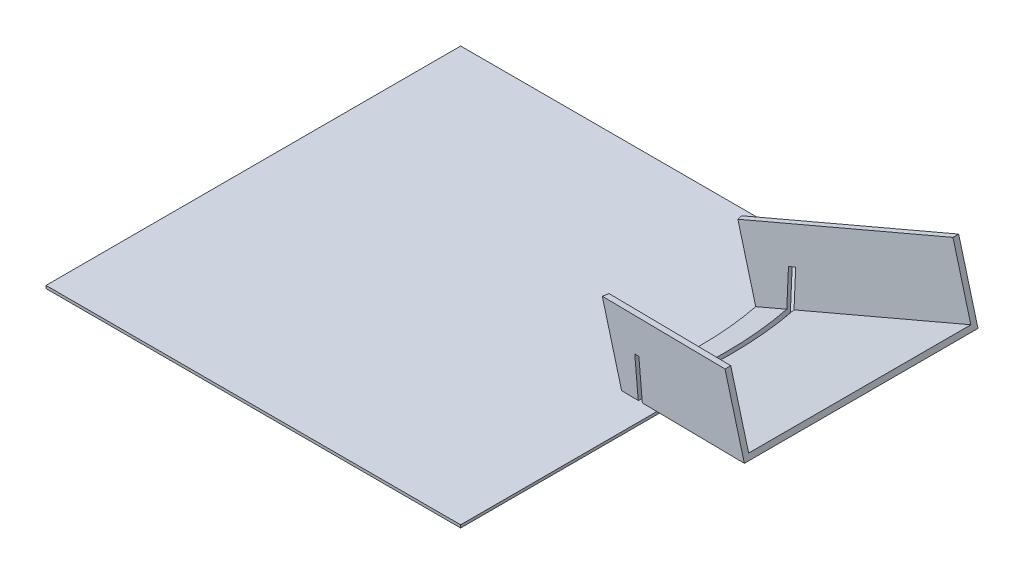
ISO-10303-21;
HEADER;
FILE_DESCRIPTION(('STEP AP214'),'2;1');
FILE_NAME('part.step','',(''),(''),'','','');
FILE_SCHEMA(('AUTOMOTIVE_DESIGN { 1 0 10303 214 1 1 1 1 }'));
ENDSEC;
DATA;
#1=APPLICATION_CONTEXT('core data for automotive mechanical design processes');
#2=APPLICATION_PROTOCOL_DEFINITION('international standard','automotive_design',2000,#1);
#3=PRODUCT_CONTEXT('',#1,'mechanical');
#4=PRODUCT('Part','Part','',(#3));
#5=PRODUCT_RELATED_PRODUCT_CATEGORY('part','',(#4));
#6=PRODUCT_DEFINITION_FORMATION('','',#4);
#7=PRODUCT_DEFINITION_CONTEXT('part definition',#1,'design');
#8=PRODUCT_DEFINITION('design','',#6,#7);
#9=PRODUCT_DEFINITION_SHAPE('','',#8);
#10=(LENGTH_UNIT() NAMED_UNIT(*) SI_UNIT(.MILLI.,.METRE.));
#11=(NAMED_UNIT(*) PLANE_ANGLE_UNIT() SI_UNIT($,.RADIAN.));
#12=(NAMED_UNIT(*) SI_UNIT($,.STERADIAN.) SOLID_ANGLE_UNIT());
#13=UNCERTAINTY_MEASURE_WITH_UNIT(LENGTH_MEASURE(1.E-05),#10,'distance_accuracy_value','');
#14=(GEOMETRIC_REPRESENTATION_CONTEXT(3) GLOBAL_UNCERTAINTY_ASSIGNED_CONTEXT((#13)) GLOBAL_UNIT_ASSIGNED_CONTEXT((#10,
#11,#12)) REPRESENTATION_CONTEXT('',''));
#15=CARTESIAN_POINT('',(0.,0.,0.));
#16=DIRECTION('',(0.,0.,1.));
#17=DIRECTION('',(1.,0.,0.));
#18=AXIS2_PLACEMENT_3D('',#15,#16,#17);
#19=CARTESIAN_POINT('',(-0.51763809020504,1.93185165257812,0.));
#20=DIRECTION('',(0.258819045102521,-0.965925826289068,0.));
#21=DIRECTION('',(0.965925826289068,0.258819045102521,0.));
#22=AXIS2_PLACEMENT_3D('',#19,#20,#21);
#23=PLANE('',#22);
#24=CARTESIAN_POINT('',(87.0769130288738,25.402740886302,-40.6746874108865));
#25=CARTESIAN_POINT('',(87.6211851797941,25.5485781696039,-39.4258886918014));
#26=CARTESIAN_POINT('',(88.1403614387907,25.6876910289315,-38.1653688409543));
#27=CARTESIAN_POINT('',(89.1276975815809,25.9522469510501,-35.6230861519321));
#28=CARTESIAN_POINT('',(89.5958572152935,26.0776899468323,-34.3413232096598));
#29=CARTESIAN_POINT('',(90.4805150127521,26.3147332892392,-31.7582261636563));
#30=CARTESIAN_POINT('',(90.8969915009452,26.4263278279171,-30.4568841033974));
#31=CARTESIAN_POINT('',(91.6773367046445,26.6354206950658,-27.8374148489102));
#32=CARTESIAN_POINT('',(92.0412058564802,26.7329191404508,-26.5192877939967));
#33=CARTESIAN_POINT('',(92.7157250357641,26.9136560098192,-23.8684575904087));
#34=CARTESIAN_POINT('',(93.0263727396073,26.9968938111946,-22.5357538080271));
#35=CARTESIAN_POINT('',(93.5938930621964,27.1489604233206,-19.8581303997071));
#36=CARTESIAN_POINT('',(93.850765684609,27.2177892350537,-18.5132107746015));
#37=CARTESIAN_POINT('',(94.3101880028607,27.3408910742141,-15.8140900174759));
#38=CARTESIAN_POINT('',(94.5127621792461,27.3951706611839,-14.4598933514064));
#39=CARTESIAN_POINT('',(94.8633753764952,27.4891171842425,-11.7440737327836));
#40=CARTESIAN_POINT('',(95.0114191296456,27.5287853883437,-10.3824514350575));
#41=CARTESIAN_POINT('',(95.2523608878193,27.5933455378693,-7.65830794900354));
#42=CARTESIAN_POINT('',(95.3454309143116,27.6182835763074,-6.29580306467403));
#43=CARTESIAN_POINT('',(95.4769860741183,27.6535336751378,-3.56804055193424));
#44=CARTESIAN_POINT('',(95.515473951899,27.6638464709075,-2.20278306538561));
#45=CARTESIAN_POINT('',(95.5378419857132,27.6698399675043,0.532434532122113));
#46=CARTESIAN_POINT('',(95.5215529076747,27.6654753221984,1.90239612980265));
#47=CARTESIAN_POINT('',(95.4340193736763,27.6420207824529,4.6405242847275));
#48=CARTESIAN_POINT('',(95.3627713629109,27.622929935506,6.00869072012445));
#49=CARTESIAN_POINT('',(95.1653714661569,27.5700367925848,8.74170509227862));
#50=CARTESIAN_POINT('',(95.0391824453295,27.5362245463604,10.1065501555711));
#51=CARTESIAN_POINT('',(94.7321018581203,27.4539425510064,12.8297204511058));
#52=CARTESIAN_POINT('',(94.5512064196421,27.4054717643517,14.1880452149284));
#53=CARTESIAN_POINT('',(94.1214035544283,27.2903064337131,16.9843668998202));
#54=CARTESIAN_POINT('',(93.8688196409005,27.2226267780622,18.4217596946485));
#55=CARTESIAN_POINT('',(93.3023485176144,27.0708412980421,21.283835128287));
#56=CARTESIAN_POINT('',(92.9884489365707,26.986732158797,22.7085151413578));
#57=CARTESIAN_POINT('',(92.2999580761813,26.8022515887595,25.5422292562194));
#58=CARTESIAN_POINT('',(91.9253604748592,26.7018784639986,26.9512617118934));
#59=CARTESIAN_POINT('',(91.1157394191213,26.4849411559384,29.7524736431197));
#60=CARTESIAN_POINT('',(90.6806426160459,26.3683573189249,31.1446303971707));
#61=CARTESIAN_POINT('',(89.7512633834368,26.1193309040851,33.9074653509221));
#62=CARTESIAN_POINT('',(89.2569862949214,25.9868897573802,35.2781454762798));
#63=CARTESIAN_POINT('',(88.2103041317324,25.7064321170216,37.9952294433844));
#64=CARTESIAN_POINT('',(87.6579092615974,25.5584183576658,39.3416374984442));
#65=CARTESIAN_POINT('',(87.0769130288235,25.4027408862886,40.6746874110017));
#66=B_SPLINE_CURVE_WITH_KNOTS('',3,(#24,#25,#26,#27,#28,#29,#30,#31,#32,#33,#34,#35,#36,#37,#38,
#39,#40,#41,#42,#43,#44,#45,#46,#47,#48,#49,#50,#51,#52,#53,#54,#55,#56,#57,#58,#59,#60,#61,#62,
#63,#64,#65),.UNSPECIFIED.,.F.,.F.,(4,2,2,2,2,2,2,2,2,2,2,2,2,2,2,2,2,2,2,2,4),(0.,
4.10981028734232,8.21964071985754,12.3311890030434,16.4427031827737,20.5543968221553,
24.666090181192,28.7759266463208,32.8854063654794,36.9819577993165,41.078303245562,
45.1873160135834,49.2965945794492,53.4086549447303,57.5210064279926,61.9025117242511,
66.2849019647372,70.6677489449489,75.0559567463639,79.4437688103067,83.8308117274082),.UNSPECIFIED.);
#67=CARTESIAN_POINT('',(92.2401902959019,26.7862368603002,-25.7311529842322));
#68=VERTEX_POINT('',#67);
#69=CARTESIAN_POINT('',(92.2401902958948,26.7862368602983,25.7311529842891));
#70=VERTEX_POINT('',#69);
#71=EDGE_CURVE('E67',#68,#70,#66,.T.);
#72=ORIENTED_EDGE('',*,*,#71,.F.);
#73=DIRECTION('',(0.93301270189222,0.250000000000001,-0.258819045102518));
#74=VECTOR('',#73,1.);
#75=CARTESIAN_POINT('',(-0.517638090190828,1.93185165258193,5.49080897015602E-11));
#76=LINE('',#75,#74);
#77=CARTESIAN_POINT('',(83.4535050798215,24.4318516524532,-23.2937140590884));
#78=VERTEX_POINT('',#77);
#79=EDGE_CURVE('E302',#78,#68,#76,.T.);
#80=ORIENTED_EDGE('',*,*,#79,.F.);
#81=CARTESIAN_POINT('',(-0.517638090205043,1.93185165257814,0.));
#82=DIRECTION('',(0.258819045102521,-0.965925826289068,0.));
#83=DIRECTION('',(0.965925826289068,0.258819045102521,0.));
#84=AXIS2_PLACEMENT_3D('',#81,#82,#83);
#85=CIRCLE('',#84,90.);
#86=CARTESIAN_POINT('',(83.4535050797943,24.4318516524977,23.2937140591433));
#87=VERTEX_POINT('',#86);
#88=EDGE_CURVE('E319',#87,#78,#85,.F.);
#89=ORIENTED_EDGE('',*,*,#88,.F.);
#90=DIRECTION('',(-0.93301270189222,-0.250000000000001,-0.258819045102518));
#91=VECTOR('',#90,1.);
#92=CARTESIAN_POINT('',(-0.517638090205041,1.93185165257812,0.));
#93=LINE('',#92,#91);
#94=EDGE_CURVE('E393',#70,#87,#93,.T.);
#95=ORIENTED_EDGE('',*,*,#94,.F.);
#96=EDGE_LOOP('',(#72,#80,#89,#95));
#97=FACE_BOUND('',#96,.T.);
#98=ADVANCED_FACE('F45',(#97),#23,.F.);
#99=CARTESIAN_POINT('',(0.,0.,0.));
#100=DIRECTION('',(0.258819045102521,-0.965925826289068,0.));
#101=DIRECTION('',(0.965925826289068,0.258819045102521,0.));
#102=AXIS2_PLACEMENT_3D('',#99,#100,#101);
#103=PLANE('',#102);
#104=CARTESIAN_POINT('',(0.,0.,0.));
#105=DIRECTION('',(0.258819045102521,-0.965925826289068,0.));
#106=DIRECTION('',(0.965925826289068,0.258819045102521,0.));
#107=AXIS2_PLACEMENT_3D('',#104,#105,#106);
#108=CIRCLE('',#107,98.9);
#109=CARTESIAN_POINT('',(91.7560864879257,24.58596927508,-27.5238207236043));
#110=VERTEX_POINT('',#109);
#111=CARTESIAN_POINT('',(91.7560864879257,24.58596927508,27.5238207236043));
#112=VERTEX_POINT('',#111);
#113=EDGE_CURVE('E205',#110,#112,#108,.T.);
#114=ORIENTED_EDGE('',*,*,#113,.T.);
#115=DIRECTION('',(-0.93301270189222,-0.250000000000001,-0.258819045102518));
#116=VECTOR('',#115,1.);
#117=CARTESIAN_POINT('',(-0.499999999999989,-0.133974596215571,1.93185165257813));
#118=LINE('',#117,#116);
#119=CARTESIAN_POINT('',(83.4504069943643,22.3604691621885,25.2198134672278));
#120=VERTEX_POINT('',#119);
#121=EDGE_CURVE('E328',#112,#120,#118,.T.);
#122=ORIENTED_EDGE('',*,*,#121,.T.);
#123=CARTESIAN_POINT('',(0.,0.,0.));
#124=DIRECTION('',(0.258819045102521,-0.965925826289068,0.));
#125=DIRECTION('',(0.965925826289068,0.258819045102521,0.));
#126=AXIS2_PLACEMENT_3D('',#123,#124,#125);
#127=CIRCLE('',#126,90.);
#128=CARTESIAN_POINT('',(83.4504069943643,22.3604691621885,-25.2198134672278));
#129=VERTEX_POINT('',#128);
#130=EDGE_CURVE('E320',#120,#129,#127,.F.);
#131=ORIENTED_EDGE('',*,*,#130,.T.);
#132=DIRECTION('',(-0.93301270189222,-0.250000000000001,0.258819045102518));
#133=VECTOR('',#132,1.);
#134=CARTESIAN_POINT('',(-0.499999999999987,-0.133974596215571,-1.93185165257812));
#135=LINE('',#134,#133);
#136=EDGE_CURVE('E75',#110,#129,#135,.T.);
#137=ORIENTED_EDGE('',*,*,#136,.F.);
#138=EDGE_LOOP('',(#114,#122,#131,#137));
#139=FACE_BOUND('',#138,.T.);
#140=ADVANCED_FACE('F356',(#139),#103,.T.);
#141=CARTESIAN_POINT('',(94.2928202147177,27.3362373894069,-26.3005554312293));
#142=VERTEX_POINT('',#141);
#143=CARTESIAN_POINT('',(144.371235853023,40.754708417921,-40.1923788645118));
#144=VERTEX_POINT('',#143);
#145=EDGE_CURVE('E295',#142,#144,#76,.T.);
#146=ORIENTED_EDGE('',*,*,#145,.F.);
#147=CARTESIAN_POINT('',(89.4031004578175,26.026040929331,-40.6746874108866));
#148=CARTESIAN_POINT('',(89.947503475897,26.1719132783824,-39.3922206143324));
#149=CARTESIAN_POINT('',(90.4661278526691,26.3108782613136,-38.0980270206445));
#150=CARTESIAN_POINT('',(91.4509933415093,26.5747721737016,-35.4884546157586));
#151=CARTESIAN_POINT('',(91.9172345964103,26.6997011414304,-34.1730758623373));
#152=CARTESIAN_POINT('',(92.7964872588461,26.935296182273,-31.5234655493608));
#153=CARTESIAN_POINT('',(93.2095015198405,27.045963019969,-30.1892350046948));
#154=CARTESIAN_POINT('',(93.9816208533382,27.2528517718402,-27.5041599828305));
#155=CARTESIAN_POINT('',(94.3407259663566,27.3490736968713,-26.1533155181191));
#156=CARTESIAN_POINT('',(95.0044000237904,27.5269046245982,-23.4373677256581));
#157=CARTESIAN_POINT('',(95.3089698935274,27.6085138752331,-22.0722646402563));
#158=CARTESIAN_POINT('',(95.8630804324265,27.7569873466487,-19.3300103862722));
#159=CARTESIAN_POINT('',(96.1126160886829,27.8238502242253,-17.9528581320348));
#160=CARTESIAN_POINT('',(96.5561711841199,27.9427004538464,-15.1891354809612));
#161=CARTESIAN_POINT('',(96.7501957585116,27.9946891818664,-13.802565967452));
#162=CARTESIAN_POINT('',(97.0824396598235,28.0837136669131,-11.0221497419354));
#163=CARTESIAN_POINT('',(97.2206538469003,28.1207480467229,-9.62830237164381));
#164=CARTESIAN_POINT('',(97.4410023519082,28.1797902506931,-6.83599521458522));
#165=CARTESIAN_POINT('',(97.5231418808168,28.2017994711309,-5.43753586854547));
#166=CARTESIAN_POINT('',(97.6312259248108,28.2307605034338,-2.63813338804213));
#167=CARTESIAN_POINT('',(97.6571640996855,28.2377106164446,-1.23718999118677));
#168=CARTESIAN_POINT('',(97.6527819654069,28.2365364271035,1.56457778274479));
#169=CARTESIAN_POINT('',(97.6224626252384,28.2284123843903,2.96540216145538));
#170=CARTESIAN_POINT('',(97.5056260883888,28.197106128695,5.76437844746752));
#171=CARTESIAN_POINT('',(97.4191153173751,28.1739256374653,7.1625306420092));
#172=CARTESIAN_POINT('',(97.1927021192202,28.1132584038639,9.92161330637928));
#173=CARTESIAN_POINT('',(97.0540810293122,28.0761149947692,11.2826566572632));
#174=CARTESIAN_POINT('',(96.7236039931063,27.9875639398007,13.9976731363261));
#175=CARTESIAN_POINT('',(96.5317529504767,27.9361576078611,15.3516469040716));
#176=CARTESIAN_POINT('',(96.0951082947631,27.8191590249833,18.0505305040782));
#177=CARTESIAN_POINT('',(95.8503102434607,27.7535655848281,19.3954395667504));
#178=CARTESIAN_POINT('',(95.3082080684862,27.6083097448285,22.0737482130029));
#179=CARTESIAN_POINT('',(95.0109083277485,27.5286485193878,23.407148747597));
#180=CARTESIAN_POINT('',(94.3553376614264,27.3529888887653,26.0970394666428));
#181=CARTESIAN_POINT('',(93.9956084567449,27.256599738877,27.4531489856711));
#182=CARTESIAN_POINT('',(93.2218272012264,27.0492656763425,30.148661491175));
#183=CARTESIAN_POINT('',(92.807774791785,26.9383206676085,31.488064367301));
#184=CARTESIAN_POINT('',(91.9260116866401,26.7020529556694,34.147981457511));
#185=CARTESIAN_POINT('',(91.4582946576809,26.5767285554735,35.4684934214502));
#186=CARTESIAN_POINT('',(90.4700769691938,26.3119364238972,38.088171579805));
#187=CARTESIAN_POINT('',(89.9495764659026,26.1724687343803,39.3873378373897));
#188=CARTESIAN_POINT('',(89.4031004577687,26.0260409293179,40.6746874110017));
#189=B_SPLINE_CURVE_WITH_KNOTS('',3,(#147,#148,#149,#150,#151,#152,#153,#154,#155,#156,#157,
#158,#159,#160,#161,#162,#163,#164,#165,#166,#167,#168,#169,#170,#171,#172,#173,#174,#175,#176,
#177,#178,#179,#180,#181,#182,#183,#184,#185,#186,#187,#188),.UNSPECIFIED.,.F.,.F.,(4,2,2,2,2,2,
2,2,2,2,2,2,2,2,2,2,2,2,2,2,4),(0.,4.202238580539,8.4044657025521,12.6064674524869,
16.8084660444253,21.0103933325895,25.2127032041067,29.4146242031589,33.6169320888454,
37.8188494039254,42.0212407228,46.2235596599582,50.4253981332611,54.5300403785164,
58.6343046199552,62.7389130297611,66.8431789414018,71.0609018316735,75.2786525658494,
79.4969015728675,83.7151380944184),.UNSPECIFIED.);
#190=CARTESIAN_POINT('',(94.2928202147035,27.3362373894029,26.3005554312842));
#191=VERTEX_POINT('',#190);
#192=EDGE_CURVE('E223',#142,#191,#189,.T.);
#193=ORIENTED_EDGE('',*,*,#192,.T.);
#194=CARTESIAN_POINT('',(144.371235853007,40.7547084179166,40.1923788646268));
#195=VERTEX_POINT('',#194);
#196=EDGE_CURVE('E389',#195,#191,#93,.T.);
#197=ORIENTED_EDGE('',*,*,#196,.F.);
#198=DIRECTION('',(0.,0.,1.));
#199=VECTOR('',#198,1.);
#200=CARTESIAN_POINT('',(144.371235853155,40.7547084179563,0.));
#201=LINE('',#200,#199);
#202=EDGE_CURVE('E301',#144,#195,#201,.T.);
#203=ORIENTED_EDGE('',*,*,#202,.F.);
#204=EDGE_LOOP('',(#146,#193,#197,#203));
#205=FACE_BOUND('',#204,.T.);
#206=ADVANCED_FACE('F299',(#205),#23,.F.);
#207=CARTESIAN_POINT('',(-1.01763809020503,1.79787705636257,-1.93185165257812));
#208=DIRECTION('',(0.249999999999998,0.0669872981077802,0.965925826289069));
#209=DIRECTION('',(0.968100345886376,0.,-0.250562807085729));
#210=AXIS2_PLACEMENT_3D('',#207,#208,#209);
#211=PLANE('',#210);
#212=CARTESIAN_POINT('',(144.88887394336,38.8228567653782,-42.2629312254881));
#213=VERTEX_POINT('',#212);
#214=CARTESIAN_POINT('',(93.8091251306055,25.136079321416,-28.0933365511802));
#215=VERTEX_POINT('',#214);
#216=EDGE_CURVE('E322',#213,#215,#135,.T.);
#217=ORIENTED_EDGE('',*,*,#216,.T.);
#218=CARTESIAN_POINT('',(93.8091251306056,25.136079321416,-28.0933365511802));
#219=CARTESIAN_POINT('',(93.7641703607774,27.623825757459,-28.2542274968833));
#220=CARTESIAN_POINT('',(93.7188250960268,30.1115715455457,-28.4150173301275));
#221=CARTESIAN_POINT('',(93.6273535766806,35.0870618258065,-28.7363947716981));
#222=CARTESIAN_POINT('',(93.581227322085,37.5748063179805,-28.8969823800244));
#223=CARTESIAN_POINT('',(93.534710572567,40.0625501621982,-29.0574688758917));
#224=B_SPLINE_CURVE_WITH_KNOTS('',3,(#218,#219,#220,#221,#222,#223),.UNSPECIFIED.,.F.,.F.,(4,2,
4),(0.,7.4800466594052,14.9600933188104),.UNSPECIFIED.);
#225=CARTESIAN_POINT('',(93.5347105725671,40.0625501621982,-29.0574688758917));
#226=VERTEX_POINT('',#225);
#227=EDGE_CURVE('E244',#215,#226,#224,.T.);
#228=ORIENTED_EDGE('',*,*,#227,.T.);
#229=DIRECTION('',(0.93301270189222,0.250000000000001,-0.258819045102518));
#230=VECTOR('',#229,1.);
#231=CARTESIAN_POINT('',(-4.25,13.8612159321677,-1.93185165257812));
#232=LINE('',#231,#230);
#233=CARTESIAN_POINT('',(91.4811552414812,39.5123016696211,-28.4878097182201));
#234=VERTEX_POINT('',#233);
#235=EDGE_CURVE('E280',#234,#226,#232,.T.);
#236=ORIENTED_EDGE('',*,*,#235,.F.);
#237=CARTESIAN_POINT('',(91.7560864879258,24.58596927508,-27.5238207236043));
#238=CARTESIAN_POINT('',(91.7110630163059,27.073692695146,-27.6846922918092));
#239=CARTESIAN_POINT('',(91.6656403432922,29.5614154380573,-27.8454604921296));
#240=CARTESIAN_POINT('',(91.5739965944774,34.536859569571,-28.1667901570015));
#241=CARTESIAN_POINT('',(91.5277755186762,37.0245809581733,-28.327351621553));
#242=CARTESIAN_POINT('',(91.4811552414812,39.5123016696211,-28.4878097182201));
#243=B_SPLINE_CURVE_WITH_KNOTS('',3,(#237,#238,#239,#240,#241,#242),.UNSPECIFIED.,.F.,.F.,(4,2,
4),(0.,7.47997772132438,14.9599554426487),.UNSPECIFIED.);
#244=EDGE_CURVE('E267',#110,#234,#243,.T.);
#245=ORIENTED_EDGE('',*,*,#244,.F.);
#246=ORIENTED_EDGE('',*,*,#136,.T.);
#247=DIRECTION('',(0.258819045102521,-0.965925826289068,0.));
#248=VECTOR('',#247,1.);
#249=CARTESIAN_POINT('',(82.9327689041593,24.2923208147666,-25.2198134672278));
#250=LINE('',#249,#248);
#251=CARTESIAN_POINT('',(76.4622927763234,48.4404664718685,-25.2198134670994));
#252=VERTEX_POINT('',#251);
#253=EDGE_CURVE('E173',#252,#129,#250,.T.);
#254=ORIENTED_EDGE('',*,*,#253,.F.);
#255=DIRECTION('',(-0.93301270189222,-0.250000000000001,0.258819045102518));
#256=VECTOR('',#255,1.);
#257=CARTESIAN_POINT('',(-7.48811421775599,25.9460227135925,-1.93185165253147));
#258=LINE('',#257,#256);
#259=CARTESIAN_POINT('',(137.900759725481,64.9028540751533,-42.2629312254074));
#260=VERTEX_POINT('',#259);
#261=EDGE_CURVE('E346',#260,#252,#258,.T.);
#262=ORIENTED_EDGE('',*,*,#261,.F.);
#263=DIRECTION('',(0.258819045102521,-0.965925826289068,0.));
#264=VECTOR('',#263,1.);
#265=CARTESIAN_POINT('',(144.371235853155,40.7547084179563,-42.2629312254881));
#266=LINE('',#265,#264);
#267=EDGE_CURVE('E192',#260,#213,#266,.T.);
#268=ORIENTED_EDGE('',*,*,#267,.T.);
#269=EDGE_LOOP('',(#217,#228,#236,#245,#246,#254,#262,#268));
#270=FACE_BOUND('',#269,.T.);
#271=ADVANCED_FACE('F47',(#270),#211,.F.);
#272=CARTESIAN_POINT('',(-0.517638090205043,1.93185165257814,0.));
#273=DIRECTION('',(0.258819045102521,-0.965925826289068,0.));
#274=DIRECTION('',(0.965925826289068,0.258819045102521,0.));
#275=AXIS2_PLACEMENT_3D('',#272,#273,#274);
#276=CYLINDRICAL_SURFACE('',#275,90.);
#277=ORIENTED_EDGE('',*,*,#130,.F.);
#278=DIRECTION('',(0.258819045102521,-0.965925826289068,0.));
#279=VECTOR('',#278,1.);
#280=CARTESIAN_POINT('',(82.9327689041593,24.2923208147666,25.2198134672278));
#281=LINE('',#280,#279);
#282=CARTESIAN_POINT('',(76.4622927763107,48.4404664719168,25.2198134670986));
#283=VERTEX_POINT('',#282);
#284=EDGE_CURVE('E335',#283,#120,#281,.T.);
#285=ORIENTED_EDGE('',*,*,#284,.F.);
#286=CARTESIAN_POINT('',(-6.98811421807712,26.0799973096703,0.));
#287=DIRECTION('',(0.258819045102521,-0.965925826289068,0.));
#288=DIRECTION('',(0.965925826289068,0.258819045102521,0.));
#289=AXIS2_PLACEMENT_3D('',#286,#287,#288);
#290=CIRCLE('',#289,90.);
#291=CARTESIAN_POINT('',(76.9830289522313,48.5799973097244,23.2937140591433));
#292=VERTEX_POINT('',#291);
#293=EDGE_CURVE('E385',#292,#283,#290,.T.);
#294=ORIENTED_EDGE('',*,*,#293,.F.);
#295=DIRECTION('',(0.258819045102521,-0.965925826289068,0.));
#296=VECTOR('',#295,1.);
#297=CARTESIAN_POINT('',(76.9830289522313,48.5799973097244,23.2937140591433));
#298=LINE('',#297,#296);
#299=EDGE_CURVE('E307',#292,#87,#298,.T.);
#300=ORIENTED_EDGE('',*,*,#299,.T.);
#301=ORIENTED_EDGE('',*,*,#88,.T.);
#302=DIRECTION('',(0.258819045102521,-0.965925826289068,0.));
#303=VECTOR('',#302,1.);
#304=CARTESIAN_POINT('',(76.9830289522585,48.5799973096799,-23.2937140590884));
#305=LINE('',#304,#303);
#306=CARTESIAN_POINT('',(76.9830289522585,48.5799973096799,-23.2937140590884));
#307=VERTEX_POINT('',#306);
#308=EDGE_CURVE('E313',#307,#78,#305,.T.);
#309=ORIENTED_EDGE('',*,*,#308,.F.);
#310=CARTESIAN_POINT('',(-6.98811421807712,26.0799973096703,0.));
#311=DIRECTION('',(0.258819045102521,-0.965925826289068,0.));
#312=DIRECTION('',(0.965925826289068,0.258819045102521,0.));
#313=AXIS2_PLACEMENT_3D('',#310,#311,#312);
#314=CIRCLE('',#313,90.);
#315=EDGE_CURVE('E311',#252,#307,#314,.T.);
#316=ORIENTED_EDGE('',*,*,#315,.F.);
#317=ORIENTED_EDGE('',*,*,#253,.T.);
#318=EDGE_LOOP('',(#277,#285,#294,#300,#301,#309,#316,#317));
#319=FACE_BOUND('',#318,.T.);
#320=ADVANCED_FACE('F255',(#319),#276,.F.);
#321=CARTESIAN_POINT('',(-1.01763809020503,1.79787705636256,1.93185165257813));
#322=DIRECTION('',(-0.249999999999997,-0.0669872981077801,0.965925826289069));
#323=DIRECTION('',(0.968100345886376,0.,0.250562807085729));
#324=AXIS2_PLACEMENT_3D('',#321,#322,#323);
#325=PLANE('',#324);
#326=CARTESIAN_POINT('',(93.8091251306056,25.136079321416,28.0933365511802));
#327=CARTESIAN_POINT('',(93.7641703607774,27.623825757459,28.2542274968833));
#328=CARTESIAN_POINT('',(93.7188250960268,30.1115715455457,28.4150173301275));
#329=CARTESIAN_POINT('',(93.6273535766806,35.0870618258065,28.736394771698));
#330=CARTESIAN_POINT('',(93.5812273220851,37.5748063179805,28.8969823800243));
#331=CARTESIAN_POINT('',(93.534710572567,40.0625501621982,29.0574688758917));
#332=B_SPLINE_CURVE_WITH_KNOTS('',3,(#326,#327,#328,#329,#330,#331),.UNSPECIFIED.,.F.,.F.,(4,2,
4),(0.,7.4800466594052,14.9600933188104),.UNSPECIFIED.);
#333=CARTESIAN_POINT('',(93.8091251306056,25.136079321416,28.0933365511802));
#334=VERTEX_POINT('',#333);
#335=CARTESIAN_POINT('',(93.5347105725671,40.0625501621982,29.0574688758917));
#336=VERTEX_POINT('',#335);
#337=EDGE_CURVE('E238',#334,#336,#332,.T.);
#338=ORIENTED_EDGE('',*,*,#337,.F.);
#339=CARTESIAN_POINT('',(144.88887394336,38.8228567653782,42.2629312254881));
#340=VERTEX_POINT('',#339);
#341=EDGE_CURVE('E329',#340,#334,#118,.T.);
#342=ORIENTED_EDGE('',*,*,#341,.F.);
#343=DIRECTION('',(0.258819045102521,-0.965925826289068,0.));
#344=VECTOR('',#343,1.);
#345=CARTESIAN_POINT('',(144.371235853155,40.7547084179563,42.2629312254881));
#346=LINE('',#345,#344);
#347=CARTESIAN_POINT('',(137.90075972546,64.9028540751477,42.2629312254074));
#348=VERTEX_POINT('',#347);
#349=EDGE_CURVE('E337',#348,#340,#346,.T.);
#350=ORIENTED_EDGE('',*,*,#349,.F.);
#351=DIRECTION('',(-0.93301270189222,-0.250000000000001,-0.258819045102518));
#352=VECTOR('',#351,1.);
#353=CARTESIAN_POINT('',(-7.48811421775599,25.9460227135925,1.93185165253148));
#354=LINE('',#353,#352);
#355=EDGE_CURVE('E382',#348,#283,#354,.T.);
#356=ORIENTED_EDGE('',*,*,#355,.T.);
#357=ORIENTED_EDGE('',*,*,#284,.T.);
#358=ORIENTED_EDGE('',*,*,#121,.F.);
#359=CARTESIAN_POINT('',(91.7560864879258,24.58596927508,27.5238207236043));
#360=CARTESIAN_POINT('',(91.7110630163059,27.073692695146,27.6846922918092));
#361=CARTESIAN_POINT('',(91.6656403432922,29.5614154380573,27.8454604921296));
#362=CARTESIAN_POINT('',(91.5739965944774,34.536859569571,28.1667901570015));
#363=CARTESIAN_POINT('',(91.5277755186762,37.0245809581733,28.327351621553));
#364=CARTESIAN_POINT('',(91.4811552414812,39.5123016696211,28.4878097182201));
#365=B_SPLINE_CURVE_WITH_KNOTS('',3,(#359,#360,#361,#362,#363,#364),.UNSPECIFIED.,.F.,.F.,(4,2,
4),(0.,7.47997772132437,14.9599554426487),.UNSPECIFIED.);
#366=CARTESIAN_POINT('',(91.4811552414812,39.5123016696211,28.4878097182201));
#367=VERTEX_POINT('',#366);
#368=EDGE_CURVE('E260',#112,#367,#365,.T.);
#369=ORIENTED_EDGE('',*,*,#368,.T.);
#370=DIRECTION('',(0.93301270189222,0.250000000000001,0.258819045102518));
#371=VECTOR('',#370,1.);
#372=CARTESIAN_POINT('',(-4.25,13.8612159321677,1.93185165257813));
#373=LINE('',#372,#371);
#374=EDGE_CURVE('E180',#367,#336,#373,.T.);
#375=ORIENTED_EDGE('',*,*,#374,.T.);
#376=EDGE_LOOP('',(#338,#342,#350,#356,#357,#358,#369,#375));
#377=FACE_BOUND('',#376,.T.);
#378=ADVANCED_FACE('F250',(#377),#325,.T.);
#379=CARTESIAN_POINT('',(144.371235853155,40.7547084179563,0.));
#380=DIRECTION('',(0.965925826289068,0.258819045102521,0.));
#381=DIRECTION('',(-0.258819045102521,0.965925826289068,0.));
#382=AXIS2_PLACEMENT_3D('',#379,#380,#381);
#383=PLANE('',#382);
#384=DIRECTION('',(0.,0.,1.));
#385=VECTOR('',#384,1.);
#386=CARTESIAN_POINT('',(144.88887394336,38.8228567653782,0.));
#387=LINE('',#386,#385);
#388=EDGE_CURVE('E325',#213,#340,#387,.T.);
#389=ORIENTED_EDGE('',*,*,#388,.F.);
#390=ORIENTED_EDGE('',*,*,#267,.F.);
#391=DIRECTION('',(0.,0.,1.));
#392=VECTOR('',#391,1.);
#393=CARTESIAN_POINT('',(137.90075972546,64.9028540751477,0.));
#394=LINE('',#393,#392);
#395=CARTESIAN_POINT('',(137.90075972546,64.9028540751477,-40.1923788645118));
#396=VERTEX_POINT('',#395);
#397=EDGE_CURVE('E397',#260,#396,#394,.T.);
#398=ORIENTED_EDGE('',*,*,#397,.T.);
#399=DIRECTION('',(0.258819045102521,-0.965925826289068,0.));
#400=VECTOR('',#399,1.);
#401=CARTESIAN_POINT('',(137.90075972546,64.9028540751477,-40.1923788645118));
#402=LINE('',#401,#400);
#403=EDGE_CURVE('E316',#396,#144,#402,.T.);
#404=ORIENTED_EDGE('',*,*,#403,.T.);
#405=ORIENTED_EDGE('',*,*,#202,.T.);
#406=DIRECTION('',(0.258819045102521,-0.965925826289068,0.));
#407=VECTOR('',#406,1.);
#408=CARTESIAN_POINT('',(137.900759725444,64.9028540751433,40.1923788646268));
#409=LINE('',#408,#407);
#410=CARTESIAN_POINT('',(137.900759725444,64.9028540751433,40.1923788646268));
#411=VERTEX_POINT('',#410);
#412=EDGE_CURVE('E303',#411,#195,#409,.T.);
#413=ORIENTED_EDGE('',*,*,#412,.F.);
#414=DIRECTION('',(0.,0.,-1.));
#415=VECTOR('',#414,1.);
#416=CARTESIAN_POINT('',(137.90075972546,64.9028540751477,0.));
#417=LINE('',#416,#415);
#418=EDGE_CURVE('E384',#348,#411,#417,.T.);
#419=ORIENTED_EDGE('',*,*,#418,.F.);
#420=ORIENTED_EDGE('',*,*,#349,.T.);
#421=EDGE_LOOP('',(#389,#390,#398,#404,#405,#413,#419,#420));
#422=FACE_BOUND('',#421,.T.);
#423=ADVANCED_FACE('F254',(#422),#383,.T.);
#424=ORIENTED_EDGE('',*,*,#341,.T.);
#425=CARTESIAN_POINT('',(0.,0.,0.));
#426=DIRECTION('',(0.258819045102521,-0.965925826289068,0.));
#427=DIRECTION('',(0.965925826289068,0.258819045102521,0.));
#428=AXIS2_PLACEMENT_3D('',#425,#426,#427);
#429=CIRCLE('',#428,101.1);
#430=EDGE_CURVE('E181',#215,#334,#429,.T.);
#431=ORIENTED_EDGE('',*,*,#430,.F.);
#432=ORIENTED_EDGE('',*,*,#216,.F.);
#433=ORIENTED_EDGE('',*,*,#388,.T.);
#434=EDGE_LOOP('',(#424,#431,#432,#433));
#435=FACE_BOUND('',#434,.T.);
#436=ADVANCED_FACE('F351',(#435),#103,.T.);
#437=CARTESIAN_POINT('',(-6.98811421775386,26.0799973098086,5.49080897015602E-11));
#438=DIRECTION('',(-0.249999999999997,-0.0669872981077801,-0.965925826289069));
#439=DIRECTION('',(-0.968100345886375,0.,0.250562807085729));
#440=AXIS2_PLACEMENT_3D('',#437,#438,#439);
#441=PLANE('',#440);
#442=DIRECTION('',(-0.93301270189222,-0.250000000000001,0.258819045102518));
#443=VECTOR('',#442,1.);
#444=CARTESIAN_POINT('',(-3.7499999999858,13.9951905283871,5.49079160749942E-11));
#445=LINE('',#444,#443);
#446=CARTESIAN_POINT('',(94.071722880736,40.2064421764976,-27.1358844899681));
#447=VERTEX_POINT('',#446);
#448=CARTESIAN_POINT('',(92.0189912952064,39.6564144058771,-26.5664538404806));
#449=VERTEX_POINT('',#448);
#450=EDGE_CURVE('E278',#447,#449,#445,.T.);
#451=ORIENTED_EDGE('',*,*,#450,.F.);
#452=CARTESIAN_POINT('',(94.071722880736,40.2064421764976,-27.1358844899681));
#453=CARTESIAN_POINT('',(94.1151464881801,37.7178687401159,-26.9745398975125));
#454=CARTESIAN_POINT('',(94.158180065284,35.2292951738839,-26.8130943487715));
#455=CARTESIAN_POINT('',(94.2434671588112,30.2521477817193,-26.4900013387186));
#456=CARTESIAN_POINT('',(94.2857206752345,27.7635739557867,-26.3283538774069));
#457=CARTESIAN_POINT('',(94.3275841613176,25.2750000000039,-26.1666054598097));
#458=B_SPLINE_CURVE_WITH_KNOTS('',3,(#452,#453,#454,#455,#456,#457),.UNSPECIFIED.,.F.,.F.,(4,2,
4),(0.,7.482528619166,14.965057238332),.UNSPECIFIED.);
#459=EDGE_CURVE('E231',#447,#142,#458,.T.);
#460=ORIENTED_EDGE('',*,*,#459,.T.);
#461=ORIENTED_EDGE('',*,*,#145,.T.);
#462=ORIENTED_EDGE('',*,*,#403,.F.);
#463=DIRECTION('',(0.93301270189222,0.250000000000001,-0.258819045102518));
#464=VECTOR('',#463,1.);
#465=CARTESIAN_POINT('',(-6.98811421775386,26.0799973098086,5.49080897015602E-11));
#466=LINE('',#465,#464);
#467=EDGE_CURVE('E306',#307,#396,#466,.T.);
#468=ORIENTED_EDGE('',*,*,#467,.F.);
#469=ORIENTED_EDGE('',*,*,#308,.T.);
#470=ORIENTED_EDGE('',*,*,#79,.T.);
#471=CARTESIAN_POINT('',(92.0189912952064,39.6564144058771,-26.5664538404806));
#472=CARTESIAN_POINT('',(92.0624495313511,37.1678456096164,-26.4051185323862));
#473=CARTESIAN_POINT('',(92.1055090595858,34.6792766776633,-26.243680021681));
#474=CARTESIAN_POINT('',(92.1908307002352,29.7021385423722,-25.9205965950489));
#475=CARTESIAN_POINT('',(92.23309281265,27.2135693390343,-25.7589516791219));
#476=CARTESIAN_POINT('',(92.2749562171548,24.7250000000039,-25.5972035605842));
#477=B_SPLINE_CURVE_WITH_KNOTS('',3,(#471,#472,#473,#474,#475,#476),.UNSPECIFIED.,.F.,.F.,(4,2,
4),(0.,7.48251472455187,14.9650294491038),.UNSPECIFIED.);
#478=EDGE_CURVE('E268',#449,#68,#477,.T.);
#479=ORIENTED_EDGE('',*,*,#478,.F.);
#480=EDGE_LOOP('',(#451,#460,#461,#462,#468,#469,#470,#479));
#481=FACE_BOUND('',#480,.T.);
#482=ADVANCED_FACE('F293',(#481),#441,.F.);
#483=CARTESIAN_POINT('',(-6.98811421807712,26.0799973096703,0.));
#484=DIRECTION('',(0.258819045102521,-0.965925826289068,0.));
#485=DIRECTION('',(0.965925826289068,0.258819045102521,0.));
#486=AXIS2_PLACEMENT_3D('',#483,#484,#485);
#487=PLANE('',#486);
#488=ORIENTED_EDGE('',*,*,#467,.T.);
#489=ORIENTED_EDGE('',*,*,#397,.F.);
#490=ORIENTED_EDGE('',*,*,#261,.T.);
#491=ORIENTED_EDGE('',*,*,#315,.T.);
#492=EDGE_LOOP('',(#488,#489,#490,#491));
#493=FACE_BOUND('',#492,.T.);
#494=ADVANCED_FACE('F400',(#493),#487,.F.);
#495=CARTESIAN_POINT('',(-6.98811421776808,26.0799973098048,0.));
#496=DIRECTION('',(-0.249999999999998,-0.0669872981077802,0.965925826289069));
#497=DIRECTION('',(0.968100345886376,0.,0.250562807085729));
#498=AXIS2_PLACEMENT_3D('',#495,#496,#497);
#499=PLANE('',#498);
#500=ORIENTED_EDGE('',*,*,#196,.T.);
#501=CARTESIAN_POINT('',(94.3275841613034,25.2750000000001,26.1666054598646));
#502=CARTESIAN_POINT('',(94.2857206752202,27.7635739557829,26.3283538774618));
#503=CARTESIAN_POINT('',(94.2434671587968,30.2521477817155,26.4900013387735));
#504=CARTESIAN_POINT('',(94.1581800652694,35.22929517388,26.8130943488263));
#505=CARTESIAN_POINT('',(94.1151464881655,37.717868740112,26.9745398975673));
#506=CARTESIAN_POINT('',(94.0717228807213,40.2064421764937,27.1358844900229));
#507=B_SPLINE_CURVE_WITH_KNOTS('',3,(#501,#502,#503,#504,#505,#506),.UNSPECIFIED.,.F.,.F.,(4,2,
4),(0.,7.48252861916593,14.9650572383319),.UNSPECIFIED.);
#508=CARTESIAN_POINT('',(94.0717228807213,40.2064421764937,27.1358844900229));
#509=VERTEX_POINT('',#508);
#510=EDGE_CURVE('E12',#191,#509,#507,.T.);
#511=ORIENTED_EDGE('',*,*,#510,.T.);
#512=DIRECTION('',(0.93301270189222,0.250000000000001,0.258819045102518));
#513=VECTOR('',#512,1.);
#514=CARTESIAN_POINT('',(-3.75000000000001,13.9951905283833,0.));
#515=LINE('',#514,#513);
#516=CARTESIAN_POINT('',(92.0189912951916,39.6564144058732,26.5664538405354));
#517=VERTEX_POINT('',#516);
#518=EDGE_CURVE('E60',#517,#509,#515,.T.);
#519=ORIENTED_EDGE('',*,*,#518,.F.);
#520=CARTESIAN_POINT('',(92.2749562171405,24.7250000000001,25.5972035606391));
#521=CARTESIAN_POINT('',(92.2330928126357,27.2135693390304,25.7589516791768));
#522=CARTESIAN_POINT('',(92.1908307002208,29.7021385423683,25.9205965951037));
#523=CARTESIAN_POINT('',(92.1055090595712,34.6792766776594,26.2436800217359));
#524=CARTESIAN_POINT('',(92.0624495313364,37.1678456096125,26.4051185324411));
#525=CARTESIAN_POINT('',(92.0189912951916,39.6564144058732,26.5664538405354));
#526=B_SPLINE_CURVE_WITH_KNOTS('',3,(#520,#521,#522,#523,#524,#525),.UNSPECIFIED.,.F.,.F.,(4,2,
4),(0.,7.48251472455182,14.9650294491036),.UNSPECIFIED.);
#527=EDGE_CURVE('E164',#70,#517,#526,.T.);
#528=ORIENTED_EDGE('',*,*,#527,.F.);
#529=ORIENTED_EDGE('',*,*,#94,.T.);
#530=ORIENTED_EDGE('',*,*,#299,.F.);
#531=DIRECTION('',(-0.93301270189222,-0.250000000000001,-0.258819045102518));
#532=VECTOR('',#531,1.);
#533=CARTESIAN_POINT('',(-6.98811421776808,26.0799973098048,0.));
#534=LINE('',#533,#532);
#535=EDGE_CURVE('E387',#411,#292,#534,.T.);
#536=ORIENTED_EDGE('',*,*,#535,.F.);
#537=ORIENTED_EDGE('',*,*,#412,.T.);
#538=EDGE_LOOP('',(#500,#511,#519,#528,#529,#530,#536,#537));
#539=FACE_BOUND('',#538,.T.);
#540=ADVANCED_FACE('F185',(#539),#499,.F.);
#541=CARTESIAN_POINT('',(-6.98811421807712,26.0799973096703,0.));
#542=DIRECTION('',(0.258819045102521,-0.965925826289068,0.));
#543=DIRECTION('',(0.965925826289068,0.258819045102521,0.));
#544=AXIS2_PLACEMENT_3D('',#541,#542,#543);
#545=PLANE('',#544);
#546=ORIENTED_EDGE('',*,*,#293,.T.);
#547=ORIENTED_EDGE('',*,*,#355,.F.);
#548=ORIENTED_EDGE('',*,*,#418,.T.);
#549=ORIENTED_EDGE('',*,*,#535,.T.);
#550=EDGE_LOOP('',(#546,#547,#548,#549));
#551=FACE_BOUND('',#550,.T.);
#552=ADVANCED_FACE('F215',(#551),#545,.F.);
#553=CARTESIAN_POINT('',(0.,15.,0.));
#554=DIRECTION('',(0.258819045102521,-0.965925826289068,0.));
#555=DIRECTION('',(0.965925826289068,0.258819045102521,0.));
#556=AXIS2_PLACEMENT_3D('',#553,#554,#555);
#557=CIRCLE('',#556,101.1);
#558=DIRECTION('',(0.,-1.,0.));
#559=VECTOR('',#558,1.);
#560=SURFACE_OF_LINEAR_EXTRUSION('',#557,#559);
#561=ORIENTED_EDGE('',*,*,#430,.T.);
#562=ORIENTED_EDGE('',*,*,#337,.T.);
#563=EDGE_CURVE('E207',#509,#336,#557,.T.);
#564=ORIENTED_EDGE('',*,*,#563,.F.);
#565=ORIENTED_EDGE('',*,*,#510,.F.);
#566=ORIENTED_EDGE('',*,*,#192,.F.);
#567=ORIENTED_EDGE('',*,*,#459,.F.);
#568=EDGE_CURVE('E210',#226,#447,#557,.T.);
#569=ORIENTED_EDGE('',*,*,#568,.F.);
#570=ORIENTED_EDGE('',*,*,#227,.F.);
#571=EDGE_LOOP('',(#561,#562,#564,#565,#566,#567,#569,#570));
#572=FACE_BOUND('',#571,.T.);
#573=ADVANCED_FACE('F212',(#572),#560,.F.);
#574=CARTESIAN_POINT('',(0.,15.,0.));
#575=DIRECTION('',(0.258819045102521,-0.965925826289068,0.));
#576=DIRECTION('',(0.965925826289068,0.258819045102521,0.));
#577=AXIS2_PLACEMENT_3D('',#574,#575,#576);
#578=PLANE('',#577);
#579=ORIENTED_EDGE('',*,*,#235,.T.);
#580=ORIENTED_EDGE('',*,*,#568,.T.);
#581=ORIENTED_EDGE('',*,*,#450,.T.);
#582=CARTESIAN_POINT('',(0.,15.,0.));
#583=DIRECTION('',(0.258819045102521,-0.965925826289068,0.));
#584=DIRECTION('',(0.965925826289068,0.258819045102521,0.));
#585=AXIS2_PLACEMENT_3D('',#582,#583,#584);
#586=CIRCLE('',#585,98.9);
#587=EDGE_CURVE('E182',#234,#449,#586,.T.);
#588=ORIENTED_EDGE('',*,*,#587,.F.);
#589=EDGE_LOOP('',(#579,#580,#581,#588));
#590=FACE_BOUND('',#589,.T.);
#591=ADVANCED_FACE('F200',(#590),#578,.T.);
#592=EDGE_CURVE('E168',#517,#367,#586,.T.);
#593=ORIENTED_EDGE('',*,*,#592,.F.);
#594=ORIENTED_EDGE('',*,*,#518,.T.);
#595=ORIENTED_EDGE('',*,*,#563,.T.);
#596=ORIENTED_EDGE('',*,*,#374,.F.);
#597=EDGE_LOOP('',(#593,#594,#595,#596));
#598=FACE_BOUND('',#597,.T.);
#599=ADVANCED_FACE('F176',(#598),#578,.T.);
#600=DIRECTION('',(0.,-1.,0.));
#601=VECTOR('',#600,1.);
#602=SURFACE_OF_LINEAR_EXTRUSION('',#586,#601);
#603=ORIENTED_EDGE('',*,*,#244,.T.);
#604=ORIENTED_EDGE('',*,*,#587,.T.);
#605=ORIENTED_EDGE('',*,*,#478,.T.);
#606=ORIENTED_EDGE('',*,*,#71,.T.);
#607=ORIENTED_EDGE('',*,*,#527,.T.);
#608=ORIENTED_EDGE('',*,*,#592,.T.);
#609=ORIENTED_EDGE('',*,*,#368,.F.);
#610=ORIENTED_EDGE('',*,*,#113,.F.);
#611=EDGE_LOOP('',(#603,#604,#605,#606,#607,#608,#609,#610));
#612=FACE_BOUND('',#611,.T.);
#613=ADVANCED_FACE('F166',(#612),#602,.T.);
#614=CLOSED_SHELL('',(#98,#140,#206,#271,#320,#378,#423,#436,#482,#494,#540,#552,#573,#591,#599,#613));
#615=MANIFOLD_SOLID_BREP('B2',#614);
#616=CARTESIAN_POINT('',(-75.,1.,-75.));
#617=DIRECTION('',(1.,0.,0.));
#618=DIRECTION('',(0.,0.,-1.));
#619=AXIS2_PLACEMENT_3D('',#616,#617,#618);
#620=PLANE('',#619);
#621=DIRECTION('',(0.,0.,1.));
#622=VECTOR('',#621,1.);
#623=CARTESIAN_POINT('',(-75.,0.,-75.));
#624=LINE('',#623,#622);
#625=CARTESIAN_POINT('',(-75.,0.,-75.));
#626=VERTEX_POINT('',#625);
#627=CARTESIAN_POINT('',(-75.,0.,75.));
#628=VERTEX_POINT('',#627);
#629=EDGE_CURVE('E709',#626,#628,#624,.T.);
#630=ORIENTED_EDGE('',*,*,#629,.T.);
#631=DIRECTION('',(0.,-1.,0.));
#632=VECTOR('',#631,1.);
#633=CARTESIAN_POINT('',(-75.,1.,75.));
#634=LINE('',#633,#632);
#635=CARTESIAN_POINT('',(-75.,1.,75.));
#636=VERTEX_POINT('',#635);
#637=EDGE_CURVE('E43',#636,#628,#634,.T.);
#638=ORIENTED_EDGE('',*,*,#637,.F.);
#639=DIRECTION('',(0.,0.,1.));
#640=VECTOR('',#639,1.);
#641=CARTESIAN_POINT('',(-75.,1.,-75.));
#642=LINE('',#641,#640);
#643=CARTESIAN_POINT('',(-75.,1.,-75.));
#644=VERTEX_POINT('',#643);
#645=EDGE_CURVE('E697',#644,#636,#642,.T.);
#646=ORIENTED_EDGE('',*,*,#645,.F.);
#647=DIRECTION('',(0.,-1.,0.));
#648=VECTOR('',#647,1.);
#649=CARTESIAN_POINT('',(-75.,1.,-75.));
#650=LINE('',#649,#648);
#651=EDGE_CURVE('E705',#644,#626,#650,.T.);
#652=ORIENTED_EDGE('',*,*,#651,.T.);
#653=EDGE_LOOP('',(#630,#638,#646,#652));
#654=FACE_BOUND('',#653,.T.);
#655=ADVANCED_FACE('F646',(#654),#620,.F.);
#656=CARTESIAN_POINT('',(-75.,1.,75.));
#657=DIRECTION('',(0.,0.,-1.));
#658=DIRECTION('',(-1.,0.,0.));
#659=AXIS2_PLACEMENT_3D('',#656,#657,#658);
#660=PLANE('',#659);
#661=DIRECTION('',(1.,0.,0.));
#662=VECTOR('',#661,1.);
#663=CARTESIAN_POINT('',(-75.,0.,75.));
#664=LINE('',#663,#662);
#665=CARTESIAN_POINT('',(75.,0.,75.));
#666=VERTEX_POINT('',#665);
#667=EDGE_CURVE('E701',#628,#666,#664,.T.);
#668=ORIENTED_EDGE('',*,*,#667,.T.);
#669=DIRECTION('',(0.,-1.,0.));
#670=VECTOR('',#669,1.);
#671=CARTESIAN_POINT('',(75.,1.,75.));
#672=LINE('',#671,#670);
#673=CARTESIAN_POINT('',(75.,1.,75.));
#674=VERTEX_POINT('',#673);
#675=EDGE_CURVE('E654',#674,#666,#672,.T.);
#676=ORIENTED_EDGE('',*,*,#675,.F.);
#677=DIRECTION('',(1.,0.,0.));
#678=VECTOR('',#677,1.);
#679=CARTESIAN_POINT('',(-75.,1.,75.));
#680=LINE('',#679,#678);
#681=EDGE_CURVE('E692',#636,#674,#680,.T.);
#682=ORIENTED_EDGE('',*,*,#681,.F.);
#683=ORIENTED_EDGE('',*,*,#637,.T.);
#684=EDGE_LOOP('',(#668,#676,#682,#683));
#685=FACE_BOUND('',#684,.T.);
#686=ADVANCED_FACE('F700',(#685),#660,.F.);
#687=CARTESIAN_POINT('',(75.,1.,-75.));
#688=DIRECTION('',(-1.,0.,0.));
#689=DIRECTION('',(0.,0.,1.));
#690=AXIS2_PLACEMENT_3D('',#687,#688,#689);
#691=PLANE('',#690);
#692=DIRECTION('',(0.,0.,-1.));
#693=VECTOR('',#692,1.);
#694=CARTESIAN_POINT('',(75.,0.,-75.));
#695=LINE('',#694,#693);
#696=CARTESIAN_POINT('',(75.,0.,-75.));
#697=VERTEX_POINT('',#696);
#698=EDGE_CURVE('E679',#666,#697,#695,.T.);
#699=ORIENTED_EDGE('',*,*,#698,.T.);
#700=DIRECTION('',(0.,-1.,0.));
#701=VECTOR('',#700,1.);
#702=CARTESIAN_POINT('',(75.,1.,-75.));
#703=LINE('',#702,#701);
#704=CARTESIAN_POINT('',(75.,1.,-75.));
#705=VERTEX_POINT('',#704);
#706=EDGE_CURVE('E702',#705,#697,#703,.T.);
#707=ORIENTED_EDGE('',*,*,#706,.F.);
#708=DIRECTION('',(0.,0.,-1.));
#709=VECTOR('',#708,1.);
#710=CARTESIAN_POINT('',(75.,1.,-75.));
#711=LINE('',#710,#709);
#712=EDGE_CURVE('E695',#674,#705,#711,.T.);
#713=ORIENTED_EDGE('',*,*,#712,.F.);
#714=ORIENTED_EDGE('',*,*,#675,.T.);
#715=EDGE_LOOP('',(#699,#707,#713,#714));
#716=FACE_BOUND('',#715,.T.);
#717=ADVANCED_FACE('F703',(#716),#691,.F.);
#718=CARTESIAN_POINT('',(-75.,1.,-75.));
#719=DIRECTION('',(0.,0.,1.));
#720=DIRECTION('',(1.,0.,0.));
#721=AXIS2_PLACEMENT_3D('',#718,#719,#720);
#722=PLANE('',#721);
#723=DIRECTION('',(-1.,0.,0.));
#724=VECTOR('',#723,1.);
#725=CARTESIAN_POINT('',(-75.,0.,-75.));
#726=LINE('',#725,#724);
#727=EDGE_CURVE('E685',#697,#626,#726,.T.);
#728=ORIENTED_EDGE('',*,*,#727,.T.);
#729=ORIENTED_EDGE('',*,*,#651,.F.);
#730=DIRECTION('',(-1.,0.,0.));
#731=VECTOR('',#730,1.);
#732=CARTESIAN_POINT('',(-75.,1.,-75.));
#733=LINE('',#732,#731);
#734=EDGE_CURVE('E662',#705,#644,#733,.T.);
#735=ORIENTED_EDGE('',*,*,#734,.F.);
#736=ORIENTED_EDGE('',*,*,#706,.T.);
#737=EDGE_LOOP('',(#728,#729,#735,#736));
#738=FACE_BOUND('',#737,.T.);
#739=ADVANCED_FACE('F716',(#738),#722,.F.);
#740=CARTESIAN_POINT('',(0.,1.,0.));
#741=DIRECTION('',(0.,1.,0.));
#742=DIRECTION('',(0.,0.,1.));
#743=AXIS2_PLACEMENT_3D('',#740,#741,#742);
#744=PLANE('',#743);
#745=ORIENTED_EDGE('',*,*,#645,.T.);
#746=ORIENTED_EDGE('',*,*,#681,.T.);
#747=ORIENTED_EDGE('',*,*,#712,.T.);
#748=ORIENTED_EDGE('',*,*,#734,.T.);
#749=EDGE_LOOP('',(#745,#746,#747,#748));
#750=FACE_BOUND('',#749,.T.);
#751=ADVANCED_FACE('F693',(#750),#744,.T.);
#752=CARTESIAN_POINT('',(0.,0.,0.));
#753=DIRECTION('',(0.,1.,0.));
#754=DIRECTION('',(0.,0.,1.));
#755=AXIS2_PLACEMENT_3D('',#752,#753,#754);
#756=PLANE('',#755);
#757=ORIENTED_EDGE('',*,*,#629,.F.);
#758=ORIENTED_EDGE('',*,*,#727,.F.);
#759=ORIENTED_EDGE('',*,*,#698,.F.);
#760=ORIENTED_EDGE('',*,*,#667,.F.);
#761=EDGE_LOOP('',(#757,#758,#759,#760));
#762=FACE_BOUND('',#761,.T.);
#763=ADVANCED_FACE('F719',(#762),#756,.F.);
#764=CLOSED_SHELL('',(#655,#686,#717,#739,#751,#763));
#765=MANIFOLD_SOLID_BREP('B6',#764);
#766=ADVANCED_BREP_SHAPE_REPRESENTATION('',(#18,#615,#765),#14);
#767=SHAPE_DEFINITION_REPRESENTATION(#9,#766);
ENDSEC;
END-ISO-10303-21;
